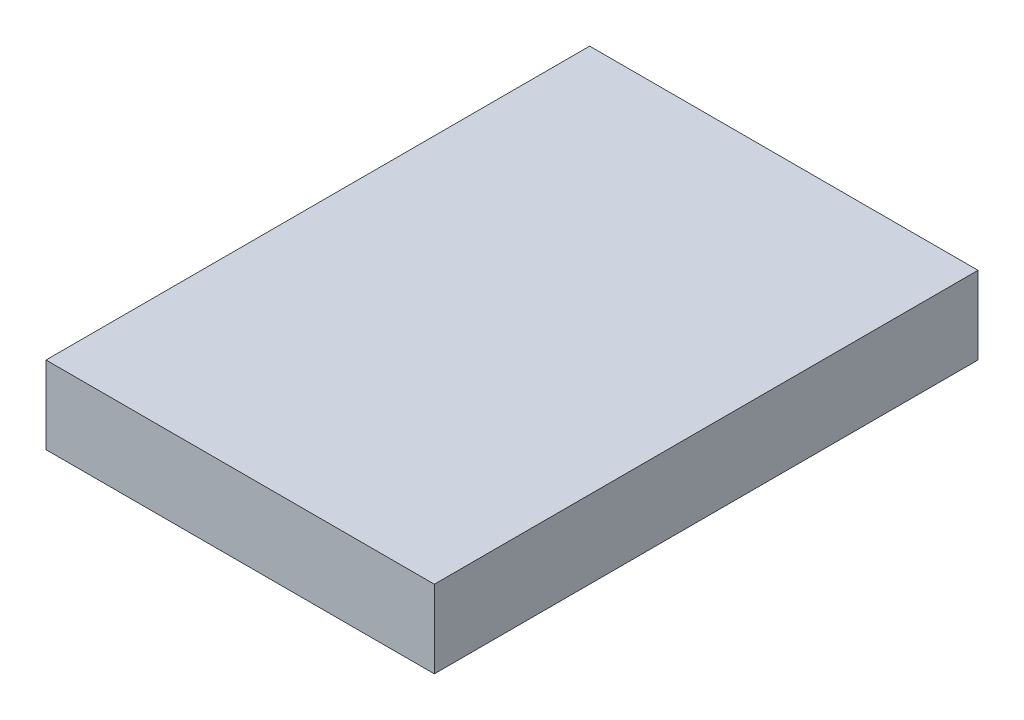
ISO-10303-21;
HEADER;
FILE_DESCRIPTION(('STEP AP214'),'2;1');
FILE_NAME('part.step','',(''),(''),'','','');
FILE_SCHEMA(('AUTOMOTIVE_DESIGN { 1 0 10303 214 1 1 1 1 }'));
ENDSEC;
DATA;
#1=APPLICATION_CONTEXT('core data for automotive mechanical design processes');
#2=APPLICATION_PROTOCOL_DEFINITION('international standard','automotive_design',2000,#1);
#3=PRODUCT_CONTEXT('',#1,'mechanical');
#4=PRODUCT('Part','Part','',(#3));
#5=PRODUCT_RELATED_PRODUCT_CATEGORY('part','',(#4));
#6=PRODUCT_DEFINITION_FORMATION('','',#4);
#7=PRODUCT_DEFINITION_CONTEXT('part definition',#1,'design');
#8=PRODUCT_DEFINITION('design','',#6,#7);
#9=PRODUCT_DEFINITION_SHAPE('','',#8);
#10=(LENGTH_UNIT() NAMED_UNIT(*) SI_UNIT(.MILLI.,.METRE.));
#11=(NAMED_UNIT(*) PLANE_ANGLE_UNIT() SI_UNIT($,.RADIAN.));
#12=(NAMED_UNIT(*) SI_UNIT($,.STERADIAN.) SOLID_ANGLE_UNIT());
#13=UNCERTAINTY_MEASURE_WITH_UNIT(LENGTH_MEASURE(1.E-05),#10,'distance_accuracy_value','');
#14=(GEOMETRIC_REPRESENTATION_CONTEXT(3) GLOBAL_UNCERTAINTY_ASSIGNED_CONTEXT((#13)) GLOBAL_UNIT_ASSIGNED_CONTEXT((#10,
#11,#12)) REPRESENTATION_CONTEXT('',''));
#15=CARTESIAN_POINT('',(0.,0.,0.));
#16=DIRECTION('',(0.,0.,1.));
#17=DIRECTION('',(1.,0.,0.));
#18=AXIS2_PLACEMENT_3D('',#15,#16,#17);
#19=CARTESIAN_POINT('',(12.5,5.,17.5));
#20=DIRECTION('',(-1.,0.,0.));
#21=DIRECTION('',(0.,0.,1.));
#22=AXIS2_PLACEMENT_3D('',#19,#20,#21);
#23=PLANE('',#22);
#24=DIRECTION('',(0.,0.,-1.));
#25=VECTOR('',#24,1.);
#26=CARTESIAN_POINT('',(12.5,0.,17.5));
#27=LINE('',#26,#25);
#28=CARTESIAN_POINT('',(12.5,0.,17.5));
#29=VERTEX_POINT('',#28);
#30=CARTESIAN_POINT('',(12.5,0.,-17.5));
#31=VERTEX_POINT('',#30);
#32=EDGE_CURVE('E96',#29,#31,#27,.T.);
#33=ORIENTED_EDGE('',*,*,#32,.T.);
#34=DIRECTION('',(0.,-1.,0.));
#35=VECTOR('',#34,1.);
#36=CARTESIAN_POINT('',(12.5,5.,-17.5));
#37=LINE('',#36,#35);
#38=CARTESIAN_POINT('',(12.5,5.,-17.5));
#39=VERTEX_POINT('',#38);
#40=EDGE_CURVE('E11',#39,#31,#37,.T.);
#41=ORIENTED_EDGE('',*,*,#40,.F.);
#42=DIRECTION('',(0.,0.,-1.));
#43=VECTOR('',#42,1.);
#44=CARTESIAN_POINT('',(12.5,5.,17.5));
#45=LINE('',#44,#43);
#46=CARTESIAN_POINT('',(12.5,5.,17.5));
#47=VERTEX_POINT('',#46);
#48=EDGE_CURVE('E84',#47,#39,#45,.T.);
#49=ORIENTED_EDGE('',*,*,#48,.F.);
#50=DIRECTION('',(0.,-1.,0.));
#51=VECTOR('',#50,1.);
#52=CARTESIAN_POINT('',(12.5,5.,17.5));
#53=LINE('',#52,#51);
#54=EDGE_CURVE('E92',#47,#29,#53,.T.);
#55=ORIENTED_EDGE('',*,*,#54,.T.);
#56=EDGE_LOOP('',(#33,#41,#49,#55));
#57=FACE_BOUND('',#56,.T.);
#58=ADVANCED_FACE('F33',(#57),#23,.F.);
#59=CARTESIAN_POINT('',(-12.5,5.,-17.5));
#60=DIRECTION('',(0.,0.,1.));
#61=DIRECTION('',(1.,0.,0.));
#62=AXIS2_PLACEMENT_3D('',#59,#60,#61);
#63=PLANE('',#62);
#64=DIRECTION('',(-1.,0.,0.));
#65=VECTOR('',#64,1.);
#66=CARTESIAN_POINT('',(-12.5,0.,-17.5));
#67=LINE('',#66,#65);
#68=CARTESIAN_POINT('',(-12.5,0.,-17.5));
#69=VERTEX_POINT('',#68);
#70=EDGE_CURVE('E88',#31,#69,#67,.T.);
#71=ORIENTED_EDGE('',*,*,#70,.T.);
#72=DIRECTION('',(0.,-1.,0.));
#73=VECTOR('',#72,1.);
#74=CARTESIAN_POINT('',(-12.5,5.,-17.5));
#75=LINE('',#74,#73);
#76=CARTESIAN_POINT('',(-12.5,5.,-17.5));
#77=VERTEX_POINT('',#76);
#78=EDGE_CURVE('E41',#77,#69,#75,.T.);
#79=ORIENTED_EDGE('',*,*,#78,.F.);
#80=DIRECTION('',(-1.,0.,0.));
#81=VECTOR('',#80,1.);
#82=CARTESIAN_POINT('',(-12.5,5.,-17.5));
#83=LINE('',#82,#81);
#84=EDGE_CURVE('E79',#39,#77,#83,.T.);
#85=ORIENTED_EDGE('',*,*,#84,.F.);
#86=ORIENTED_EDGE('',*,*,#40,.T.);
#87=EDGE_LOOP('',(#71,#79,#85,#86));
#88=FACE_BOUND('',#87,.T.);
#89=ADVANCED_FACE('F87',(#88),#63,.F.);
#90=CARTESIAN_POINT('',(-12.5,5.,17.5));
#91=DIRECTION('',(1.,0.,0.));
#92=DIRECTION('',(0.,0.,-1.));
#93=AXIS2_PLACEMENT_3D('',#90,#91,#92);
#94=PLANE('',#93);
#95=DIRECTION('',(0.,0.,1.));
#96=VECTOR('',#95,1.);
#97=CARTESIAN_POINT('',(-12.5,0.,17.5));
#98=LINE('',#97,#96);
#99=CARTESIAN_POINT('',(-12.5,0.,17.5));
#100=VERTEX_POINT('',#99);
#101=EDGE_CURVE('E66',#69,#100,#98,.T.);
#102=ORIENTED_EDGE('',*,*,#101,.T.);
#103=DIRECTION('',(0.,-1.,0.));
#104=VECTOR('',#103,1.);
#105=CARTESIAN_POINT('',(-12.5,5.,17.5));
#106=LINE('',#105,#104);
#107=CARTESIAN_POINT('',(-12.5,5.,17.5));
#108=VERTEX_POINT('',#107);
#109=EDGE_CURVE('E89',#108,#100,#106,.T.);
#110=ORIENTED_EDGE('',*,*,#109,.F.);
#111=DIRECTION('',(0.,0.,1.));
#112=VECTOR('',#111,1.);
#113=CARTESIAN_POINT('',(-12.5,5.,17.5));
#114=LINE('',#113,#112);
#115=EDGE_CURVE('E82',#77,#108,#114,.T.);
#116=ORIENTED_EDGE('',*,*,#115,.F.);
#117=ORIENTED_EDGE('',*,*,#78,.T.);
#118=EDGE_LOOP('',(#102,#110,#116,#117));
#119=FACE_BOUND('',#118,.T.);
#120=ADVANCED_FACE('F90',(#119),#94,.F.);
#121=CARTESIAN_POINT('',(-12.5,5.,17.5));
#122=DIRECTION('',(0.,0.,-1.));
#123=DIRECTION('',(-1.,0.,0.));
#124=AXIS2_PLACEMENT_3D('',#121,#122,#123);
#125=PLANE('',#124);
#126=DIRECTION('',(1.,0.,0.));
#127=VECTOR('',#126,1.);
#128=CARTESIAN_POINT('',(-12.5,0.,17.5));
#129=LINE('',#128,#127);
#130=EDGE_CURVE('E72',#100,#29,#129,.T.);
#131=ORIENTED_EDGE('',*,*,#130,.T.);
#132=ORIENTED_EDGE('',*,*,#54,.F.);
#133=DIRECTION('',(1.,0.,0.));
#134=VECTOR('',#133,1.);
#135=CARTESIAN_POINT('',(-12.5,5.,17.5));
#136=LINE('',#135,#134);
#137=EDGE_CURVE('E49',#108,#47,#136,.T.);
#138=ORIENTED_EDGE('',*,*,#137,.F.);
#139=ORIENTED_EDGE('',*,*,#109,.T.);
#140=EDGE_LOOP('',(#131,#132,#138,#139));
#141=FACE_BOUND('',#140,.T.);
#142=ADVANCED_FACE('F103',(#141),#125,.F.);
#143=CARTESIAN_POINT('',(0.,5.,0.));
#144=DIRECTION('',(0.,-1.,0.));
#145=DIRECTION('',(0.,0.,-1.));
#146=AXIS2_PLACEMENT_3D('',#143,#144,#145);
#147=PLANE('',#146);
#148=ORIENTED_EDGE('',*,*,#48,.T.);
#149=ORIENTED_EDGE('',*,*,#84,.T.);
#150=ORIENTED_EDGE('',*,*,#115,.T.);
#151=ORIENTED_EDGE('',*,*,#137,.T.);
#152=EDGE_LOOP('',(#148,#149,#150,#151));
#153=FACE_BOUND('',#152,.T.);
#154=ADVANCED_FACE('F80',(#153),#147,.F.);
#155=CARTESIAN_POINT('',(0.,0.,0.));
#156=DIRECTION('',(0.,-1.,0.));
#157=DIRECTION('',(0.,0.,-1.));
#158=AXIS2_PLACEMENT_3D('',#155,#156,#157);
#159=PLANE('',#158);
#160=ORIENTED_EDGE('',*,*,#32,.F.);
#161=ORIENTED_EDGE('',*,*,#130,.F.);
#162=ORIENTED_EDGE('',*,*,#101,.F.);
#163=ORIENTED_EDGE('',*,*,#70,.F.);
#164=EDGE_LOOP('',(#160,#161,#162,#163));
#165=FACE_BOUND('',#164,.T.);
#166=ADVANCED_FACE('F106',(#165),#159,.T.);
#167=CLOSED_SHELL('',(#58,#89,#120,#142,#154,#166));
#168=MANIFOLD_SOLID_BREP('B2',#167);
#169=ADVANCED_BREP_SHAPE_REPRESENTATION('',(#18,#168),#14);
#170=SHAPE_DEFINITION_REPRESENTATION(#9,#169);
ENDSEC;
END-ISO-10303-21;
